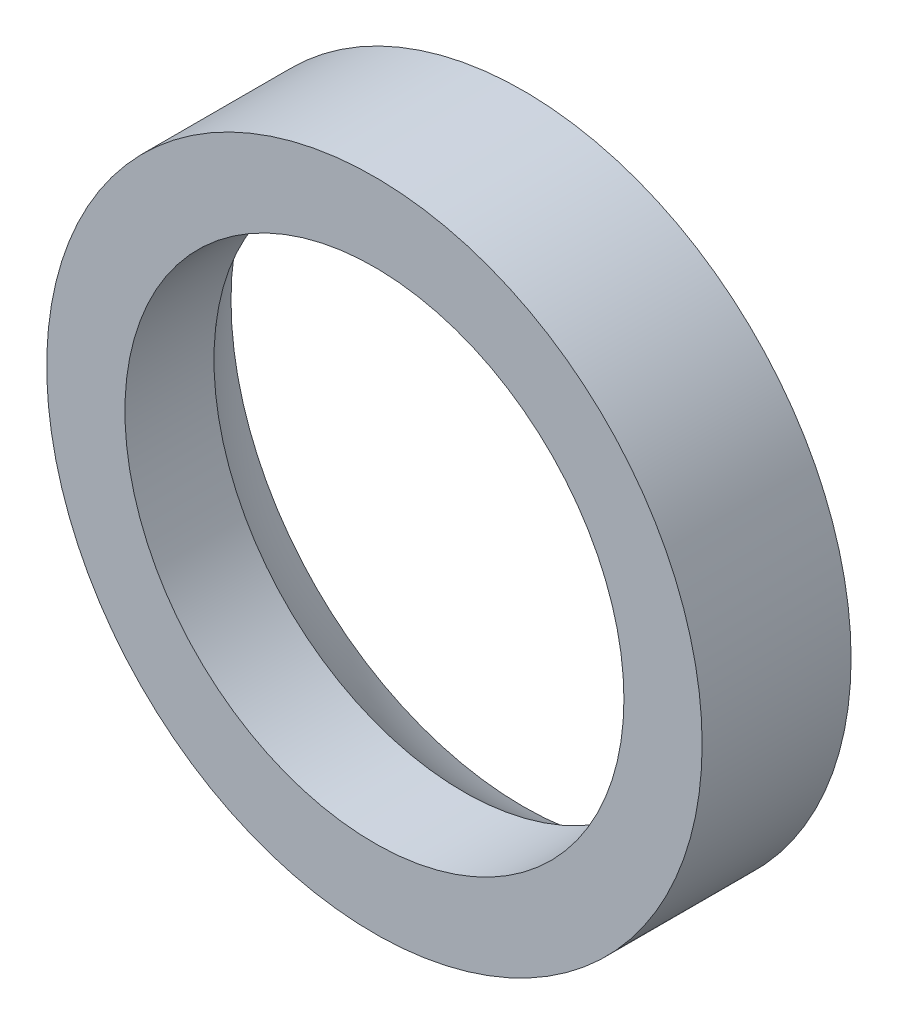
ISO-10303-21;
HEADER;
FILE_DESCRIPTION(('STEP AP214'),'2;1');
FILE_NAME('part.step','',(''),(''),'','','');
FILE_SCHEMA(('AUTOMOTIVE_DESIGN { 1 0 10303 214 1 1 1 1 }'));
ENDSEC;
DATA;
#1=APPLICATION_CONTEXT('core data for automotive mechanical design processes');
#2=APPLICATION_PROTOCOL_DEFINITION('international standard','automotive_design',2000,#1);
#3=PRODUCT_CONTEXT('',#1,'mechanical');
#4=PRODUCT('Part','Part','',(#3));
#5=PRODUCT_RELATED_PRODUCT_CATEGORY('part','',(#4));
#6=PRODUCT_DEFINITION_FORMATION('','',#4);
#7=PRODUCT_DEFINITION_CONTEXT('part definition',#1,'design');
#8=PRODUCT_DEFINITION('design','',#6,#7);
#9=PRODUCT_DEFINITION_SHAPE('','',#8);
#10=(LENGTH_UNIT() NAMED_UNIT(*) SI_UNIT(.MILLI.,.METRE.));
#11=(NAMED_UNIT(*) PLANE_ANGLE_UNIT() SI_UNIT($,.RADIAN.));
#12=(NAMED_UNIT(*) SI_UNIT($,.STERADIAN.) SOLID_ANGLE_UNIT());
#13=UNCERTAINTY_MEASURE_WITH_UNIT(LENGTH_MEASURE(1.E-05),#10,'distance_accuracy_value','');
#14=(GEOMETRIC_REPRESENTATION_CONTEXT(3) GLOBAL_UNCERTAINTY_ASSIGNED_CONTEXT((#13)) GLOBAL_UNIT_ASSIGNED_CONTEXT((#10,
#11,#12)) REPRESENTATION_CONTEXT('',''));
#15=CARTESIAN_POINT('',(0.,0.,0.));
#16=DIRECTION('',(0.,0.,1.));
#17=DIRECTION('',(1.,0.,0.));
#18=AXIS2_PLACEMENT_3D('',#15,#16,#17);
#19=CARTESIAN_POINT('',(0.,0.,0.));
#20=DIRECTION('',(0.,0.,1.));
#21=DIRECTION('',(1.,0.,0.));
#22=AXIS2_PLACEMENT_3D('',#19,#20,#21);
#23=CYLINDRICAL_SURFACE('',#22,4.4);
#24=CARTESIAN_POINT('',(0.,0.,2.));
#25=DIRECTION('',(0.,0.,1.));
#26=DIRECTION('',(1.,0.,0.));
#27=AXIS2_PLACEMENT_3D('',#24,#25,#26);
#28=CIRCLE('',#27,4.4);
#29=CARTESIAN_POINT('',(4.4,0.,2.));
#30=VERTEX_POINT('',#29);
#31=EDGE_CURVE('E51',#30,#30,#28,.T.);
#32=ORIENTED_EDGE('',*,*,#31,.F.);
#33=EDGE_LOOP('',(#32));
#34=FACE_BOUND('',#33,.T.);
#35=CARTESIAN_POINT('',(0.,0.,0.));
#36=DIRECTION('',(0.,0.,1.));
#37=DIRECTION('',(1.,0.,0.));
#38=AXIS2_PLACEMENT_3D('',#35,#36,#37);
#39=CIRCLE('',#38,4.4);
#40=CARTESIAN_POINT('',(4.4,0.,0.));
#41=VERTEX_POINT('',#40);
#42=EDGE_CURVE('E10',#41,#41,#39,.T.);
#43=ORIENTED_EDGE('',*,*,#42,.T.);
#44=EDGE_LOOP('',(#43));
#45=FACE_BOUND('',#44,.T.);
#46=ADVANCED_FACE('F32',(#34,#45),#23,.T.);
#47=CARTESIAN_POINT('',(0.,3.9255572852781,0.));
#48=DIRECTION('',(0.,0.,1.));
#49=DIRECTION('',(1.,0.,0.));
#50=AXIS2_PLACEMENT_3D('',#47,#48,#49);
#51=PLANE('',#50);
#52=ORIENTED_EDGE('',*,*,#42,.F.);
#53=EDGE_LOOP('',(#52));
#54=FACE_BOUND('',#53,.T.);
#55=CARTESIAN_POINT('',(0.,0.,0.));
#56=DIRECTION('',(0.,0.,1.));
#57=DIRECTION('',(1.,0.,0.));
#58=AXIS2_PLACEMENT_3D('',#55,#56,#57);
#59=CIRCLE('',#58,3.9255572852781);
#60=CARTESIAN_POINT('',(3.9255572852781,0.,0.));
#61=VERTEX_POINT('',#60);
#62=EDGE_CURVE('E38',#61,#61,#59,.T.);
#63=ORIENTED_EDGE('',*,*,#62,.T.);
#64=EDGE_LOOP('',(#63));
#65=FACE_BOUND('',#64,.T.);
#66=ADVANCED_FACE('F58',(#54,#65),#51,.F.);
#67=CARTESIAN_POINT('',(0.,1.9151347174784E-12,-2.19999999999862));
#68=DIRECTION('',(0.,0.,1.));
#69=DIRECTION('',(0.,1.,0.));
#70=AXIS2_PLACEMENT_3D('',#67,#68,#69);
#71=SPHERICAL_SURFACE('',#70,4.49999999999765);
#72=ORIENTED_EDGE('',*,*,#62,.F.);
#73=EDGE_LOOP('',(#72));
#74=FACE_BOUND('',#73,.T.);
#75=CARTESIAN_POINT('',(0.,0.,0.80457983751472));
#76=DIRECTION('',(0.,0.,1.));
#77=DIRECTION('',(1.,0.,0.));
#78=AXIS2_PLACEMENT_3D('',#75,#76,#77);
#79=CIRCLE('',#78,3.35);
#80=CARTESIAN_POINT('',(3.35,0.,0.80457983751472));
#81=VERTEX_POINT('',#80);
#82=EDGE_CURVE('E42',#81,#81,#79,.T.);
#83=ORIENTED_EDGE('',*,*,#82,.T.);
#84=EDGE_LOOP('',(#83));
#85=FACE_BOUND('',#84,.T.);
#86=ADVANCED_FACE('F62',(#74,#85),#71,.F.);
#87=CARTESIAN_POINT('',(0.,0.,0.));
#88=DIRECTION('',(0.,0.,1.));
#89=DIRECTION('',(1.,0.,0.));
#90=AXIS2_PLACEMENT_3D('',#87,#88,#89);
#91=CYLINDRICAL_SURFACE('',#90,3.35);
#92=ORIENTED_EDGE('',*,*,#82,.F.);
#93=EDGE_LOOP('',(#92));
#94=FACE_BOUND('',#93,.T.);
#95=CARTESIAN_POINT('',(0.,0.,2.));
#96=DIRECTION('',(0.,0.,1.));
#97=DIRECTION('',(1.,0.,0.));
#98=AXIS2_PLACEMENT_3D('',#95,#96,#97);
#99=CIRCLE('',#98,3.35);
#100=CARTESIAN_POINT('',(3.35,0.,2.));
#101=VERTEX_POINT('',#100);
#102=EDGE_CURVE('E46',#101,#101,#99,.T.);
#103=ORIENTED_EDGE('',*,*,#102,.T.);
#104=EDGE_LOOP('',(#103));
#105=FACE_BOUND('',#104,.T.);
#106=ADVANCED_FACE('F67',(#94,#105),#91,.F.);
#107=CARTESIAN_POINT('',(0.,4.4,2.));
#108=DIRECTION('',(0.,0.,-1.));
#109=DIRECTION('',(-1.,0.,0.));
#110=AXIS2_PLACEMENT_3D('',#107,#108,#109);
#111=PLANE('',#110);
#112=ORIENTED_EDGE('',*,*,#102,.F.);
#113=EDGE_LOOP('',(#112));
#114=FACE_BOUND('',#113,.T.);
#115=ORIENTED_EDGE('',*,*,#31,.T.);
#116=EDGE_LOOP('',(#115));
#117=FACE_BOUND('',#116,.T.);
#118=ADVANCED_FACE('F55',(#114,#117),#111,.F.);
#119=CLOSED_SHELL('',(#46,#66,#86,#106,#118));
#120=MANIFOLD_SOLID_BREP('B2',#119);
#121=ADVANCED_BREP_SHAPE_REPRESENTATION('',(#18,#120),#14);
#122=SHAPE_DEFINITION_REPRESENTATION(#9,#121);
ENDSEC;
END-ISO-10303-21;
